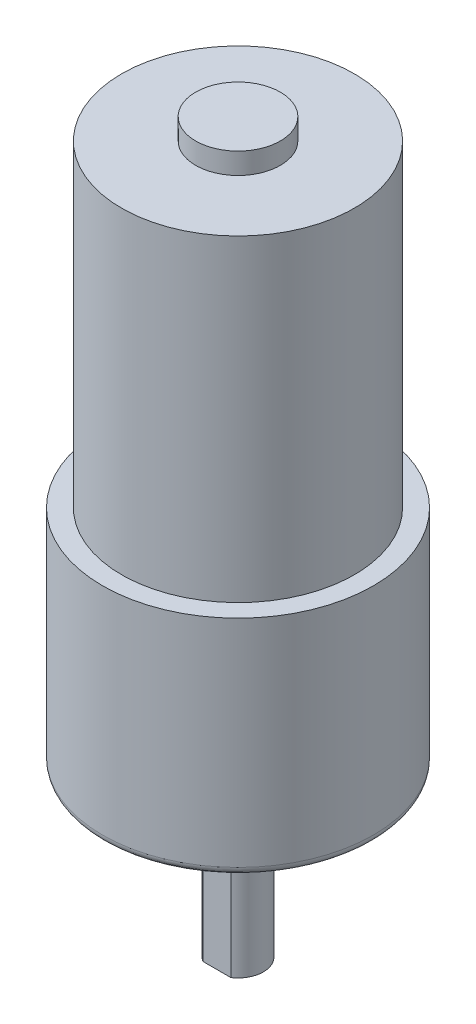
ISO-10303-21;
HEADER;
FILE_DESCRIPTION(('STEP AP214'),'2;1');
FILE_NAME('part.step','',(''),(''),'','','');
FILE_SCHEMA(('AUTOMOTIVE_DESIGN { 1 0 10303 214 1 1 1 1 }'));
ENDSEC;
DATA;
#1=APPLICATION_CONTEXT('core data for automotive mechanical design processes');
#2=APPLICATION_PROTOCOL_DEFINITION('international standard','automotive_design',2000,#1);
#3=PRODUCT_CONTEXT('',#1,'mechanical');
#4=PRODUCT('Part','Part','',(#3));
#5=PRODUCT_RELATED_PRODUCT_CATEGORY('part','',(#4));
#6=PRODUCT_DEFINITION_FORMATION('','',#4);
#7=PRODUCT_DEFINITION_CONTEXT('part definition',#1,'design');
#8=PRODUCT_DEFINITION('design','',#6,#7);
#9=PRODUCT_DEFINITION_SHAPE('','',#8);
#10=(LENGTH_UNIT() NAMED_UNIT(*) SI_UNIT(.MILLI.,.METRE.));
#11=(NAMED_UNIT(*) PLANE_ANGLE_UNIT() SI_UNIT($,.RADIAN.));
#12=(NAMED_UNIT(*) SI_UNIT($,.STERADIAN.) SOLID_ANGLE_UNIT());
#13=UNCERTAINTY_MEASURE_WITH_UNIT(LENGTH_MEASURE(1.E-05),#10,'distance_accuracy_value','');
#14=(GEOMETRIC_REPRESENTATION_CONTEXT(3) GLOBAL_UNCERTAINTY_ASSIGNED_CONTEXT((#13)) GLOBAL_UNIT_ASSIGNED_CONTEXT((#10,
#11,#12)) REPRESENTATION_CONTEXT('',''));
#15=CARTESIAN_POINT('',(0.,0.,0.));
#16=DIRECTION('',(0.,0.,1.));
#17=DIRECTION('',(1.,0.,0.));
#18=AXIS2_PLACEMENT_3D('',#15,#16,#17);
#19=CARTESIAN_POINT('',(0.,3.,0.));
#20=DIRECTION('',(0.,-1.,0.));
#21=DIRECTION('',(0.,0.,-1.));
#22=AXIS2_PLACEMENT_3D('',#19,#20,#21);
#23=CYLINDRICAL_SURFACE('',#22,10.);
#24=DIRECTION('',(0.,-1.,0.));
#25=VECTOR('',#24,1.);
#26=CARTESIAN_POINT('',(-9.,3.,-4.35889894354068));
#27=LINE('',#26,#25);
#28=CARTESIAN_POINT('',(-9.,3.,-4.35889894354068));
#29=VERTEX_POINT('',#28);
#30=CARTESIAN_POINT('',(-9.,0.,-4.35889894354068));
#31=VERTEX_POINT('',#30);
#32=EDGE_CURVE('E38',#29,#31,#27,.T.);
#33=ORIENTED_EDGE('',*,*,#32,.F.);
#34=CARTESIAN_POINT('',(0.,3.,0.));
#35=DIRECTION('',(0.,1.,0.));
#36=DIRECTION('',(1.,0.,0.));
#37=AXIS2_PLACEMENT_3D('',#34,#35,#36);
#38=CIRCLE('',#37,10.);
#39=CARTESIAN_POINT('',(9.,3.,-4.35889894354067));
#40=VERTEX_POINT('',#39);
#41=EDGE_CURVE('E167',#40,#29,#38,.T.);
#42=ORIENTED_EDGE('',*,*,#41,.F.);
#43=DIRECTION('',(0.,1.,0.));
#44=VECTOR('',#43,1.);
#45=CARTESIAN_POINT('',(9.,3.,-4.35889894354067));
#46=LINE('',#45,#44);
#47=CARTESIAN_POINT('',(9.,0.,-4.35889894354067));
#48=VERTEX_POINT('',#47);
#49=EDGE_CURVE('E48',#48,#40,#46,.T.);
#50=ORIENTED_EDGE('',*,*,#49,.F.);
#51=CARTESIAN_POINT('',(0.,0.,0.));
#52=DIRECTION('',(0.,1.,0.));
#53=DIRECTION('',(1.,0.,0.));
#54=AXIS2_PLACEMENT_3D('',#51,#52,#53);
#55=CIRCLE('',#54,10.);
#56=EDGE_CURVE('E11',#48,#31,#55,.T.);
#57=ORIENTED_EDGE('',*,*,#56,.T.);
#58=EDGE_LOOP('',(#33,#42,#50,#57));
#59=FACE_BOUND('',#58,.T.);
#60=ADVANCED_FACE('F16',(#59),#23,.T.);
#61=CARTESIAN_POINT('',(0.,3.,0.));
#62=DIRECTION('',(0.,-1.,0.));
#63=DIRECTION('',(0.,0.,-1.));
#64=AXIS2_PLACEMENT_3D('',#61,#62,#63);
#65=CYLINDRICAL_SURFACE('',#64,10.);
#66=DIRECTION('',(0.,1.,0.));
#67=VECTOR('',#66,1.);
#68=CARTESIAN_POINT('',(-9.,3.,4.35889894354068));
#69=LINE('',#68,#67);
#70=CARTESIAN_POINT('',(-9.,0.,4.35889894354068));
#71=VERTEX_POINT('',#70);
#72=CARTESIAN_POINT('',(-9.,3.,4.35889894354068));
#73=VERTEX_POINT('',#72);
#74=EDGE_CURVE('E222',#71,#73,#69,.T.);
#75=ORIENTED_EDGE('',*,*,#74,.F.);
#76=CARTESIAN_POINT('',(0.,0.,0.));
#77=DIRECTION('',(0.,1.,0.));
#78=DIRECTION('',(1.,0.,0.));
#79=AXIS2_PLACEMENT_3D('',#76,#77,#78);
#80=CIRCLE('',#79,10.);
#81=CARTESIAN_POINT('',(9.,0.,4.35889894354067));
#82=VERTEX_POINT('',#81);
#83=EDGE_CURVE('E26',#71,#82,#80,.T.);
#84=ORIENTED_EDGE('',*,*,#83,.T.);
#85=DIRECTION('',(0.,-1.,0.));
#86=VECTOR('',#85,1.);
#87=CARTESIAN_POINT('',(9.,3.,4.35889894354067));
#88=LINE('',#87,#86);
#89=CARTESIAN_POINT('',(9.,3.,4.35889894354067));
#90=VERTEX_POINT('',#89);
#91=EDGE_CURVE('E217',#90,#82,#88,.T.);
#92=ORIENTED_EDGE('',*,*,#91,.F.);
#93=CARTESIAN_POINT('',(0.,3.,0.));
#94=DIRECTION('',(0.,1.,0.));
#95=DIRECTION('',(1.,0.,0.));
#96=AXIS2_PLACEMENT_3D('',#93,#94,#95);
#97=CIRCLE('',#96,10.);
#98=EDGE_CURVE('E157',#73,#90,#97,.T.);
#99=ORIENTED_EDGE('',*,*,#98,.F.);
#100=EDGE_LOOP('',(#75,#84,#92,#99));
#101=FACE_BOUND('',#100,.T.);
#102=ADVANCED_FACE('F303',(#101),#65,.T.);
#103=CARTESIAN_POINT('',(0.,0.,0.));
#104=DIRECTION('',(0.,1.,0.));
#105=DIRECTION('',(1.,0.,0.));
#106=AXIS2_PLACEMENT_3D('',#103,#104,#105);
#107=PLANE('',#106);
#108=CARTESIAN_POINT('',(0.,0.,0.));
#109=DIRECTION('',(0.,1.,0.));
#110=DIRECTION('',(1.,0.,0.));
#111=AXIS2_PLACEMENT_3D('',#108,#109,#110);
#112=CIRCLE('',#111,3.);
#113=CARTESIAN_POINT('',(3.,0.,0.));
#114=VERTEX_POINT('',#113);
#115=EDGE_CURVE('E243',#114,#114,#112,.T.);
#116=ORIENTED_EDGE('',*,*,#115,.T.);
#117=EDGE_LOOP('',(#116));
#118=FACE_BOUND('',#117,.T.);
#119=DIRECTION('',(0.,0.,-1.));
#120=VECTOR('',#119,1.);
#121=CARTESIAN_POINT('',(-9.,0.,11.499491353001));
#122=LINE('',#121,#120);
#123=EDGE_CURVE('E190',#71,#31,#122,.T.);
#124=ORIENTED_EDGE('',*,*,#123,.T.);
#125=ORIENTED_EDGE('',*,*,#56,.F.);
#126=DIRECTION('',(0.,0.,1.));
#127=VECTOR('',#126,1.);
#128=CARTESIAN_POINT('',(9.,0.,-13.0815869786368));
#129=LINE('',#128,#127);
#130=EDGE_CURVE('E186',#48,#82,#129,.T.);
#131=ORIENTED_EDGE('',*,*,#130,.T.);
#132=ORIENTED_EDGE('',*,*,#83,.F.);
#133=EDGE_LOOP('',(#124,#125,#131,#132));
#134=FACE_BOUND('',#133,.T.);
#135=ADVANCED_FACE('F308',(#118,#134),#107,.F.);
#136=CARTESIAN_POINT('',(0.,3.,0.));
#137=DIRECTION('',(0.,-1.,0.));
#138=DIRECTION('',(0.,0.,-1.));
#139=AXIS2_PLACEMENT_3D('',#136,#137,#138);
#140=PLANE('',#139);
#141=CARTESIAN_POINT('',(-9.19238815542512,3.,9.19238815542512));
#142=DIRECTION('',(0.,1.,0.));
#143=DIRECTION('',(0.,0.,-1.));
#144=AXIS2_PLACEMENT_3D('',#141,#142,#143);
#145=CIRCLE('',#144,1.3105);
#146=CARTESIAN_POINT('',(-9.19238815542512,3.,7.88188815542512));
#147=VERTEX_POINT('',#146);
#148=EDGE_CURVE('E191',#147,#147,#145,.T.);
#149=ORIENTED_EDGE('',*,*,#148,.T.);
#150=EDGE_LOOP('',(#149));
#151=FACE_BOUND('',#150,.T.);
#152=ORIENTED_EDGE('',*,*,#41,.T.);
#153=DIRECTION('',(0.,0.,-1.));
#154=VECTOR('',#153,1.);
#155=CARTESIAN_POINT('',(-9.,3.,11.499491353001));
#156=LINE('',#155,#154);
#157=EDGE_CURVE('E208',#73,#29,#156,.T.);
#158=ORIENTED_EDGE('',*,*,#157,.F.);
#159=ORIENTED_EDGE('',*,*,#98,.T.);
#160=DIRECTION('',(0.,0.,1.));
#161=VECTOR('',#160,1.);
#162=CARTESIAN_POINT('',(9.,3.,-13.0815869786368));
#163=LINE('',#162,#161);
#164=EDGE_CURVE('E229',#40,#90,#163,.T.);
#165=ORIENTED_EDGE('',*,*,#164,.F.);
#166=EDGE_LOOP('',(#152,#158,#159,#165));
#167=FACE_BOUND('',#166,.T.);
#168=CARTESIAN_POINT('',(-9.19238815542512,3.,-9.19238815542512));
#169=DIRECTION('',(0.,1.,0.));
#170=DIRECTION('',(0.,0.,-1.));
#171=AXIS2_PLACEMENT_3D('',#168,#169,#170);
#172=CIRCLE('',#171,1.3105);
#173=CARTESIAN_POINT('',(-9.19238815542512,3.,-10.5028881554251));
#174=VERTEX_POINT('',#173);
#175=EDGE_CURVE('E153',#174,#174,#172,.T.);
#176=ORIENTED_EDGE('',*,*,#175,.T.);
#177=EDGE_LOOP('',(#176));
#178=FACE_BOUND('',#177,.T.);
#179=CARTESIAN_POINT('',(0.,3.,0.));
#180=DIRECTION('',(0.,-1.,0.));
#181=DIRECTION('',(0.,0.,-1.));
#182=AXIS2_PLACEMENT_3D('',#179,#180,#181);
#183=CIRCLE('',#182,15.);
#184=CARTESIAN_POINT('',(0.,3.,-15.));
#185=VERTEX_POINT('',#184);
#186=EDGE_CURVE('E158',#185,#185,#183,.T.);
#187=ORIENTED_EDGE('',*,*,#186,.T.);
#188=EDGE_LOOP('',(#187));
#189=FACE_BOUND('',#188,.T.);
#190=CARTESIAN_POINT('',(9.19238815542512,3.,-9.19238815542511));
#191=DIRECTION('',(0.,1.,0.));
#192=DIRECTION('',(0.,0.,-1.));
#193=AXIS2_PLACEMENT_3D('',#190,#191,#192);
#194=CIRCLE('',#193,1.3105);
#195=CARTESIAN_POINT('',(9.19238815542512,3.,-10.5028881554251));
#196=VERTEX_POINT('',#195);
#197=EDGE_CURVE('E171',#196,#196,#194,.T.);
#198=ORIENTED_EDGE('',*,*,#197,.T.);
#199=EDGE_LOOP('',(#198));
#200=FACE_BOUND('',#199,.T.);
#201=CARTESIAN_POINT('',(9.19238815542512,3.,9.19238815542512));
#202=DIRECTION('',(0.,1.,0.));
#203=DIRECTION('',(0.,0.,-1.));
#204=AXIS2_PLACEMENT_3D('',#201,#202,#203);
#205=CIRCLE('',#204,1.3105);
#206=CARTESIAN_POINT('',(9.19238815542512,3.,7.88188815542512));
#207=VERTEX_POINT('',#206);
#208=EDGE_CURVE('E202',#207,#207,#205,.T.);
#209=ORIENTED_EDGE('',*,*,#208,.T.);
#210=EDGE_LOOP('',(#209));
#211=FACE_BOUND('',#210,.T.);
#212=ADVANCED_FACE('F452',(#151,#167,#178,#189,#200,#211),#140,.T.);
#213=CARTESIAN_POINT('',(0.,29.5,0.));
#214=DIRECTION('',(0.,-1.,0.));
#215=DIRECTION('',(0.,0.,-1.));
#216=AXIS2_PLACEMENT_3D('',#213,#214,#215);
#217=CYLINDRICAL_SURFACE('',#216,16.);
#218=CARTESIAN_POINT('',(0.,4.,0.));
#219=DIRECTION('',(0.,1.,0.));
#220=DIRECTION('',(0.,0.,-1.));
#221=AXIS2_PLACEMENT_3D('',#218,#219,#220);
#222=CIRCLE('',#221,16.);
#223=CARTESIAN_POINT('',(0.,4.,-16.));
#224=VERTEX_POINT('',#223);
#225=EDGE_CURVE('E198',#224,#224,#222,.T.);
#226=ORIENTED_EDGE('',*,*,#225,.T.);
#227=EDGE_LOOP('',(#226));
#228=FACE_BOUND('',#227,.T.);
#229=CARTESIAN_POINT('',(0.,29.5,0.));
#230=DIRECTION('',(0.,-1.,0.));
#231=DIRECTION('',(-1.,0.,0.));
#232=AXIS2_PLACEMENT_3D('',#229,#230,#231);
#233=CIRCLE('',#232,16.);
#234=CARTESIAN_POINT('',(-16.,29.5,0.));
#235=VERTEX_POINT('',#234);
#236=EDGE_CURVE('E203',#235,#235,#233,.T.);
#237=ORIENTED_EDGE('',*,*,#236,.T.);
#238=EDGE_LOOP('',(#237));
#239=FACE_BOUND('',#238,.T.);
#240=ADVANCED_FACE('F445',(#228,#239),#217,.T.);
#241=CARTESIAN_POINT('',(0.,29.5,0.));
#242=DIRECTION('',(0.,-1.,0.));
#243=DIRECTION('',(0.,0.,-1.));
#244=AXIS2_PLACEMENT_3D('',#241,#242,#243);
#245=PLANE('',#244);
#246=CARTESIAN_POINT('',(0.,29.5,0.));
#247=DIRECTION('',(0.,-1.,0.));
#248=DIRECTION('',(-1.,0.,0.));
#249=AXIS2_PLACEMENT_3D('',#246,#247,#248);
#250=CIRCLE('',#249,13.75);
#251=CARTESIAN_POINT('',(-13.75,29.5,0.));
#252=VERTEX_POINT('',#251);
#253=EDGE_CURVE('E185',#252,#252,#250,.T.);
#254=ORIENTED_EDGE('',*,*,#253,.T.);
#255=EDGE_LOOP('',(#254));
#256=FACE_BOUND('',#255,.T.);
#257=ORIENTED_EDGE('',*,*,#236,.F.);
#258=EDGE_LOOP('',(#257));
#259=FACE_BOUND('',#258,.T.);
#260=ADVANCED_FACE('F356',(#256,#259),#245,.F.);
#261=CARTESIAN_POINT('',(0.,67.,0.));
#262=DIRECTION('',(0.,-1.,0.));
#263=DIRECTION('',(0.,0.,-1.));
#264=AXIS2_PLACEMENT_3D('',#261,#262,#263);
#265=CYLINDRICAL_SURFACE('',#264,13.75);
#266=CARTESIAN_POINT('',(0.,67.,0.));
#267=DIRECTION('',(0.,-1.,0.));
#268=DIRECTION('',(-1.,0.,0.));
#269=AXIS2_PLACEMENT_3D('',#266,#267,#268);
#270=CIRCLE('',#269,13.75);
#271=CARTESIAN_POINT('',(-13.75,67.,0.));
#272=VERTEX_POINT('',#271);
#273=EDGE_CURVE('E181',#272,#272,#270,.T.);
#274=ORIENTED_EDGE('',*,*,#273,.T.);
#275=EDGE_LOOP('',(#274));
#276=FACE_BOUND('',#275,.T.);
#277=ORIENTED_EDGE('',*,*,#253,.F.);
#278=EDGE_LOOP('',(#277));
#279=FACE_BOUND('',#278,.T.);
#280=ADVANCED_FACE('F353',(#276,#279),#265,.T.);
#281=CARTESIAN_POINT('',(0.,67.,0.));
#282=DIRECTION('',(0.,-1.,0.));
#283=DIRECTION('',(0.,0.,-1.));
#284=AXIS2_PLACEMENT_3D('',#281,#282,#283);
#285=PLANE('',#284);
#286=CARTESIAN_POINT('',(0.,67.,0.));
#287=DIRECTION('',(0.,-1.,0.));
#288=DIRECTION('',(-1.,0.,0.));
#289=AXIS2_PLACEMENT_3D('',#286,#287,#288);
#290=CIRCLE('',#289,5.);
#291=CARTESIAN_POINT('',(-5.,67.,0.));
#292=VERTEX_POINT('',#291);
#293=EDGE_CURVE('E177',#292,#292,#290,.T.);
#294=ORIENTED_EDGE('',*,*,#293,.T.);
#295=EDGE_LOOP('',(#294));
#296=FACE_BOUND('',#295,.T.);
#297=ORIENTED_EDGE('',*,*,#273,.F.);
#298=EDGE_LOOP('',(#297));
#299=FACE_BOUND('',#298,.T.);
#300=ADVANCED_FACE('F18',(#296,#299),#285,.F.);
#301=CARTESIAN_POINT('',(0.,-16.5,0.));
#302=DIRECTION('',(0.,1.,0.));
#303=DIRECTION('',(0.,0.,1.));
#304=AXIS2_PLACEMENT_3D('',#301,#302,#303);
#305=CYLINDRICAL_SURFACE('',#304,3.);
#306=DIRECTION('',(0.,-1.,0.));
#307=VECTOR('',#306,1.);
#308=CARTESIAN_POINT('',(-1.6583123951777,-4.5,2.5));
#309=LINE('',#308,#307);
#310=CARTESIAN_POINT('',(-1.6583123951777,-4.5,2.5));
#311=VERTEX_POINT('',#310);
#312=CARTESIAN_POINT('',(-1.6583123951777,-16.5,2.5));
#313=VERTEX_POINT('',#312);
#314=EDGE_CURVE('E20',#311,#313,#309,.T.);
#315=ORIENTED_EDGE('',*,*,#314,.F.);
#316=CARTESIAN_POINT('',(0.,-4.5,0.));
#317=DIRECTION('',(0.,-1.,0.));
#318=DIRECTION('',(1.,0.,0.));
#319=AXIS2_PLACEMENT_3D('',#316,#317,#318);
#320=CIRCLE('',#319,3.);
#321=CARTESIAN_POINT('',(1.6583123951777,-4.5,2.5));
#322=VERTEX_POINT('',#321);
#323=EDGE_CURVE('E225',#322,#311,#320,.T.);
#324=ORIENTED_EDGE('',*,*,#323,.F.);
#325=DIRECTION('',(0.,-1.,0.));
#326=VECTOR('',#325,1.);
#327=CARTESIAN_POINT('',(1.6583123951777,-4.5,2.5));
#328=LINE('',#327,#326);
#329=CARTESIAN_POINT('',(1.6583123951777,-16.5,2.5));
#330=VERTEX_POINT('',#329);
#331=EDGE_CURVE('E174',#322,#330,#328,.T.);
#332=ORIENTED_EDGE('',*,*,#331,.T.);
#333=CARTESIAN_POINT('',(0.,-16.5,0.));
#334=DIRECTION('',(0.,1.,0.));
#335=DIRECTION('',(1.,0.,0.));
#336=AXIS2_PLACEMENT_3D('',#333,#334,#335);
#337=CIRCLE('',#336,3.);
#338=EDGE_CURVE('E236',#330,#313,#337,.T.);
#339=ORIENTED_EDGE('',*,*,#338,.T.);
#340=EDGE_LOOP('',(#315,#324,#332,#339));
#341=FACE_BOUND('',#340,.T.);
#342=ORIENTED_EDGE('',*,*,#115,.F.);
#343=EDGE_LOOP('',(#342));
#344=FACE_BOUND('',#343,.T.);
#345=ADVANCED_FACE('F283',(#341,#344),#305,.T.);
#346=CARTESIAN_POINT('',(0.,-16.5,0.));
#347=DIRECTION('',(0.,1.,0.));
#348=DIRECTION('',(1.,0.,0.));
#349=AXIS2_PLACEMENT_3D('',#346,#347,#348);
#350=PLANE('',#349);
#351=ORIENTED_EDGE('',*,*,#338,.F.);
#352=DIRECTION('',(1.,0.,0.));
#353=VECTOR('',#352,1.);
#354=CARTESIAN_POINT('',(-1.6583123951777,-16.5,2.5));
#355=LINE('',#354,#353);
#356=EDGE_CURVE('E232',#313,#330,#355,.T.);
#357=ORIENTED_EDGE('',*,*,#356,.F.);
#358=EDGE_LOOP('',(#351,#357));
#359=FACE_BOUND('',#358,.T.);
#360=ADVANCED_FACE('F289',(#359),#350,.F.);
#361=CARTESIAN_POINT('',(-1.6583123951777,-4.5,2.5));
#362=DIRECTION('',(0.,0.,-1.));
#363=DIRECTION('',(0.,-1.,0.));
#364=AXIS2_PLACEMENT_3D('',#361,#362,#363);
#365=PLANE('',#364);
#366=ORIENTED_EDGE('',*,*,#356,.T.);
#367=ORIENTED_EDGE('',*,*,#331,.F.);
#368=DIRECTION('',(1.,0.,0.));
#369=VECTOR('',#368,1.);
#370=CARTESIAN_POINT('',(-1.6583123951777,-4.5,2.5));
#371=LINE('',#370,#369);
#372=EDGE_CURVE('E228',#311,#322,#371,.T.);
#373=ORIENTED_EDGE('',*,*,#372,.F.);
#374=ORIENTED_EDGE('',*,*,#314,.T.);
#375=EDGE_LOOP('',(#366,#367,#373,#374));
#376=FACE_BOUND('',#375,.T.);
#377=ADVANCED_FACE('F287',(#376),#365,.F.);
#378=CARTESIAN_POINT('',(0.,-4.5,0.));
#379=DIRECTION('',(0.,-1.,0.));
#380=DIRECTION('',(0.,0.,-1.));
#381=AXIS2_PLACEMENT_3D('',#378,#379,#380);
#382=PLANE('',#381);
#383=ORIENTED_EDGE('',*,*,#323,.T.);
#384=ORIENTED_EDGE('',*,*,#372,.T.);
#385=EDGE_LOOP('',(#383,#384));
#386=FACE_BOUND('',#385,.T.);
#387=ADVANCED_FACE('F297',(#386),#382,.T.);
#388=CARTESIAN_POINT('',(-9.19238815542512,13.,9.19238815542512));
#389=DIRECTION('',(0.,1.,0.));
#390=DIRECTION('',(1.,0.,0.));
#391=AXIS2_PLACEMENT_3D('',#388,#389,#390);
#392=PLANE('',#391);
#393=CARTESIAN_POINT('',(-9.19238815542512,13.,9.19238815542512));
#394=DIRECTION('',(0.,-1.,0.));
#395=DIRECTION('',(0.,0.,-1.));
#396=AXIS2_PLACEMENT_3D('',#393,#394,#395);
#397=CIRCLE('',#396,1.3105);
#398=CARTESIAN_POINT('',(-9.19238815542512,13.,7.88188815542512));
#399=VERTEX_POINT('',#398);
#400=EDGE_CURVE('E221',#399,#399,#397,.T.);
#401=ORIENTED_EDGE('',*,*,#400,.T.);
#402=EDGE_LOOP('',(#401));
#403=FACE_BOUND('',#402,.T.);
#404=ADVANCED_FACE('F341',(#403),#392,.F.);
#405=CARTESIAN_POINT('',(-9.19238815542512,3.,9.19238815542512));
#406=DIRECTION('',(0.,1.,0.));
#407=DIRECTION('',(0.,0.,-1.));
#408=AXIS2_PLACEMENT_3D('',#405,#406,#407);
#409=CYLINDRICAL_SURFACE('',#408,1.3105);
#410=ORIENTED_EDGE('',*,*,#400,.F.);
#411=EDGE_LOOP('',(#410));
#412=FACE_BOUND('',#411,.T.);
#413=ORIENTED_EDGE('',*,*,#148,.F.);
#414=EDGE_LOOP('',(#413));
#415=FACE_BOUND('',#414,.T.);
#416=ADVANCED_FACE('F343',(#412,#415),#409,.F.);
#417=CARTESIAN_POINT('',(9.19238815542512,13.,9.19238815542512));
#418=DIRECTION('',(0.,1.,0.));
#419=DIRECTION('',(1.,0.,0.));
#420=AXIS2_PLACEMENT_3D('',#417,#418,#419);
#421=PLANE('',#420);
#422=CARTESIAN_POINT('',(9.19238815542512,13.,9.19238815542512));
#423=DIRECTION('',(0.,-1.,0.));
#424=DIRECTION('',(0.,0.,-1.));
#425=AXIS2_PLACEMENT_3D('',#422,#423,#424);
#426=CIRCLE('',#425,1.3105);
#427=CARTESIAN_POINT('',(9.19238815542512,13.,7.88188815542512));
#428=VERTEX_POINT('',#427);
#429=EDGE_CURVE('E196',#428,#428,#426,.T.);
#430=ORIENTED_EDGE('',*,*,#429,.T.);
#431=EDGE_LOOP('',(#430));
#432=FACE_BOUND('',#431,.T.);
#433=ADVANCED_FACE('F333',(#432),#421,.F.);
#434=CARTESIAN_POINT('',(9.19238815542512,3.,9.19238815542512));
#435=DIRECTION('',(0.,1.,0.));
#436=DIRECTION('',(0.,0.,-1.));
#437=AXIS2_PLACEMENT_3D('',#434,#435,#436);
#438=CYLINDRICAL_SURFACE('',#437,1.3105);
#439=ORIENTED_EDGE('',*,*,#429,.F.);
#440=EDGE_LOOP('',(#439));
#441=FACE_BOUND('',#440,.T.);
#442=ORIENTED_EDGE('',*,*,#208,.F.);
#443=EDGE_LOOP('',(#442));
#444=FACE_BOUND('',#443,.T.);
#445=ADVANCED_FACE('F331',(#441,#444),#438,.F.);
#446=CARTESIAN_POINT('',(9.19238815542512,13.,-9.19238815542511));
#447=DIRECTION('',(0.,1.,0.));
#448=DIRECTION('',(1.,0.,0.));
#449=AXIS2_PLACEMENT_3D('',#446,#447,#448);
#450=PLANE('',#449);
#451=CARTESIAN_POINT('',(9.19238815542512,13.,-9.19238815542511));
#452=DIRECTION('',(0.,-1.,0.));
#453=DIRECTION('',(0.,0.,-1.));
#454=AXIS2_PLACEMENT_3D('',#451,#452,#453);
#455=CIRCLE('',#454,1.3105);
#456=CARTESIAN_POINT('',(9.19238815542512,13.,-10.5028881554251));
#457=VERTEX_POINT('',#456);
#458=EDGE_CURVE('E192',#457,#457,#455,.T.);
#459=ORIENTED_EDGE('',*,*,#458,.T.);
#460=EDGE_LOOP('',(#459));
#461=FACE_BOUND('',#460,.T.);
#462=ADVANCED_FACE('F329',(#461),#450,.F.);
#463=CARTESIAN_POINT('',(9.19238815542512,3.,-9.19238815542511));
#464=DIRECTION('',(0.,1.,0.));
#465=DIRECTION('',(0.,0.,-1.));
#466=AXIS2_PLACEMENT_3D('',#463,#464,#465);
#467=CYLINDRICAL_SURFACE('',#466,1.3105);
#468=ORIENTED_EDGE('',*,*,#458,.F.);
#469=EDGE_LOOP('',(#468));
#470=FACE_BOUND('',#469,.T.);
#471=ORIENTED_EDGE('',*,*,#197,.F.);
#472=EDGE_LOOP('',(#471));
#473=FACE_BOUND('',#472,.T.);
#474=ADVANCED_FACE('F325',(#470,#473),#467,.F.);
#475=CARTESIAN_POINT('',(-9.19238815542512,13.,-9.19238815542512));
#476=DIRECTION('',(0.,1.,0.));
#477=DIRECTION('',(1.,0.,0.));
#478=AXIS2_PLACEMENT_3D('',#475,#476,#477);
#479=PLANE('',#478);
#480=CARTESIAN_POINT('',(-9.19238815542512,13.,-9.19238815542512));
#481=DIRECTION('',(0.,-1.,0.));
#482=DIRECTION('',(0.,0.,-1.));
#483=AXIS2_PLACEMENT_3D('',#480,#481,#482);
#484=CIRCLE('',#483,1.3105);
#485=CARTESIAN_POINT('',(-9.19238815542512,13.,-10.5028881554251));
#486=VERTEX_POINT('',#485);
#487=EDGE_CURVE('E197',#486,#486,#484,.T.);
#488=ORIENTED_EDGE('',*,*,#487,.T.);
#489=EDGE_LOOP('',(#488));
#490=FACE_BOUND('',#489,.T.);
#491=ADVANCED_FACE('F328',(#490),#479,.F.);
#492=CARTESIAN_POINT('',(-9.19238815542512,3.,-9.19238815542512));
#493=DIRECTION('',(0.,1.,0.));
#494=DIRECTION('',(0.,0.,-1.));
#495=AXIS2_PLACEMENT_3D('',#492,#493,#494);
#496=CYLINDRICAL_SURFACE('',#495,1.3105);
#497=ORIENTED_EDGE('',*,*,#487,.F.);
#498=EDGE_LOOP('',(#497));
#499=FACE_BOUND('',#498,.T.);
#500=ORIENTED_EDGE('',*,*,#175,.F.);
#501=EDGE_LOOP('',(#500));
#502=FACE_BOUND('',#501,.T.);
#503=ADVANCED_FACE('F154',(#499,#502),#496,.F.);
#504=CARTESIAN_POINT('',(0.,4.,0.));
#505=DIRECTION('',(0.,-1.,0.));
#506=DIRECTION('',(0.,0.,-1.));
#507=AXIS2_PLACEMENT_3D('',#504,#505,#506);
#508=TOROIDAL_SURFACE('',#507,15.,1.);
#509=ORIENTED_EDGE('',*,*,#225,.F.);
#510=EDGE_LOOP('',(#509));
#511=FACE_BOUND('',#510,.T.);
#512=ORIENTED_EDGE('',*,*,#186,.F.);
#513=EDGE_LOOP('',(#512));
#514=FACE_BOUND('',#513,.T.);
#515=ADVANCED_FACE('F349',(#511,#514),#508,.T.);
#516=CARTESIAN_POINT('',(9.,3.,-13.0815869786368));
#517=DIRECTION('',(1.,0.,0.));
#518=DIRECTION('',(0.,1.,0.));
#519=AXIS2_PLACEMENT_3D('',#516,#517,#518);
#520=PLANE('',#519);
#521=ORIENTED_EDGE('',*,*,#91,.T.);
#522=ORIENTED_EDGE('',*,*,#130,.F.);
#523=ORIENTED_EDGE('',*,*,#49,.T.);
#524=ORIENTED_EDGE('',*,*,#164,.T.);
#525=EDGE_LOOP('',(#521,#522,#523,#524));
#526=FACE_BOUND('',#525,.T.);
#527=ADVANCED_FACE('F322',(#526),#520,.T.);
#528=CARTESIAN_POINT('',(-9.,3.,11.499491353001));
#529=DIRECTION('',(-1.,0.,0.));
#530=DIRECTION('',(0.,0.,1.));
#531=AXIS2_PLACEMENT_3D('',#528,#529,#530);
#532=PLANE('',#531);
#533=ORIENTED_EDGE('',*,*,#32,.T.);
#534=ORIENTED_EDGE('',*,*,#123,.F.);
#535=ORIENTED_EDGE('',*,*,#74,.T.);
#536=ORIENTED_EDGE('',*,*,#157,.T.);
#537=EDGE_LOOP('',(#533,#534,#535,#536));
#538=FACE_BOUND('',#537,.T.);
#539=ADVANCED_FACE('F319',(#538),#532,.T.);
#540=CARTESIAN_POINT('',(0.,69.5,0.));
#541=DIRECTION('',(0.,-1.,0.));
#542=DIRECTION('',(0.,0.,-1.));
#543=AXIS2_PLACEMENT_3D('',#540,#541,#542);
#544=CYLINDRICAL_SURFACE('',#543,5.);
#545=CARTESIAN_POINT('',(0.,69.5,0.));
#546=DIRECTION('',(0.,-1.,0.));
#547=DIRECTION('',(-1.,0.,0.));
#548=AXIS2_PLACEMENT_3D('',#545,#546,#547);
#549=CIRCLE('',#548,5.);
#550=CARTESIAN_POINT('',(-5.,69.5,0.));
#551=VERTEX_POINT('',#550);
#552=EDGE_CURVE('E204',#551,#551,#549,.T.);
#553=ORIENTED_EDGE('',*,*,#552,.T.);
#554=EDGE_LOOP('',(#553));
#555=FACE_BOUND('',#554,.T.);
#556=ORIENTED_EDGE('',*,*,#293,.F.);
#557=EDGE_LOOP('',(#556));
#558=FACE_BOUND('',#557,.T.);
#559=ADVANCED_FACE('F314',(#555,#558),#544,.T.);
#560=CARTESIAN_POINT('',(0.,69.5,0.));
#561=DIRECTION('',(0.,-1.,0.));
#562=DIRECTION('',(0.,0.,-1.));
#563=AXIS2_PLACEMENT_3D('',#560,#561,#562);
#564=PLANE('',#563);
#565=ORIENTED_EDGE('',*,*,#552,.F.);
#566=EDGE_LOOP('',(#565));
#567=FACE_BOUND('',#566,.T.);
#568=ADVANCED_FACE('F312',(#567),#564,.F.);
#569=CLOSED_SHELL('',(#60,#102,#135,#212,#240,#260,#280,#300,#345,#360,#377,#387,#404,#416,#433,
#445,#462,#474,#491,#503,#515,#527,#539,#559,#568));
#570=MANIFOLD_SOLID_BREP('B1',#569);
#571=ADVANCED_BREP_SHAPE_REPRESENTATION('',(#18,#570),#14);
#572=SHAPE_DEFINITION_REPRESENTATION(#9,#571);
ENDSEC;
END-ISO-10303-21;
